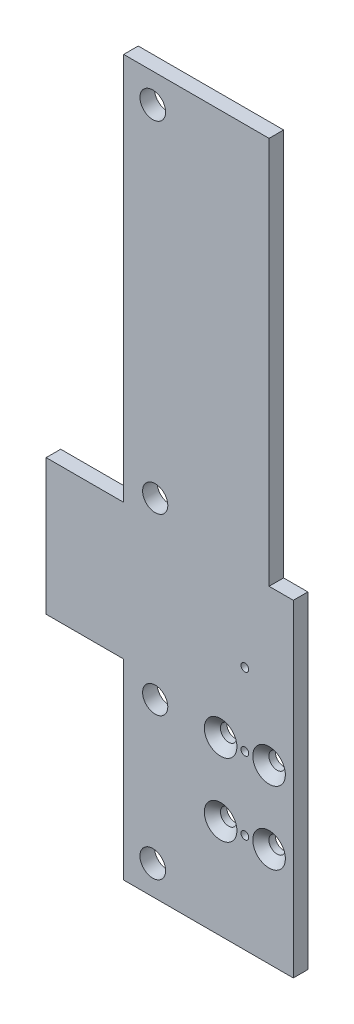
ISO-10303-21;
HEADER;
FILE_DESCRIPTION(('STEP AP214'),'2;1');
FILE_NAME('part.step','',(''),(''),'','','');
FILE_SCHEMA(('AUTOMOTIVE_DESIGN { 1 0 10303 214 1 1 1 1 }'));
ENDSEC;
DATA;
#1=APPLICATION_CONTEXT('core data for automotive mechanical design processes');
#2=APPLICATION_PROTOCOL_DEFINITION('international standard','automotive_design',2000,#1);
#3=PRODUCT_CONTEXT('',#1,'mechanical');
#4=PRODUCT('Part','Part','',(#3));
#5=PRODUCT_RELATED_PRODUCT_CATEGORY('part','',(#4));
#6=PRODUCT_DEFINITION_FORMATION('','',#4);
#7=PRODUCT_DEFINITION_CONTEXT('part definition',#1,'design');
#8=PRODUCT_DEFINITION('design','',#6,#7);
#9=PRODUCT_DEFINITION_SHAPE('','',#8);
#10=(LENGTH_UNIT() NAMED_UNIT(*) SI_UNIT(.MILLI.,.METRE.));
#11=(NAMED_UNIT(*) PLANE_ANGLE_UNIT() SI_UNIT($,.RADIAN.));
#12=(NAMED_UNIT(*) SI_UNIT($,.STERADIAN.) SOLID_ANGLE_UNIT());
#13=UNCERTAINTY_MEASURE_WITH_UNIT(LENGTH_MEASURE(1.E-05),#10,'distance_accuracy_value','');
#14=(GEOMETRIC_REPRESENTATION_CONTEXT(3) GLOBAL_UNCERTAINTY_ASSIGNED_CONTEXT((#13)) GLOBAL_UNIT_ASSIGNED_CONTEXT((#10,
#11,#12)) REPRESENTATION_CONTEXT('',''));
#15=CARTESIAN_POINT('',(0.,0.,0.));
#16=DIRECTION('',(0.,0.,1.));
#17=DIRECTION('',(1.,0.,0.));
#18=AXIS2_PLACEMENT_3D('',#15,#16,#17);
#19=CARTESIAN_POINT('',(-41.,32.,0.));
#20=DIRECTION('',(0.,1.,0.));
#21=DIRECTION('',(0.,0.,1.));
#22=AXIS2_PLACEMENT_3D('',#19,#20,#21);
#23=PLANE('',#22);
#24=DIRECTION('',(-1.,0.,0.));
#25=VECTOR('',#24,1.);
#26=CARTESIAN_POINT('',(-41.,32.,0.));
#27=LINE('',#26,#25);
#28=CARTESIAN_POINT('',(10.,32.,0.));
#29=VERTEX_POINT('',#28);
#30=CARTESIAN_POINT('',(5.00000000000001,32.,0.));
#31=VERTEX_POINT('',#30);
#32=EDGE_CURVE('E172',#29,#31,#27,.T.);
#33=ORIENTED_EDGE('',*,*,#32,.T.);
#34=DIRECTION('',(0.,0.,1.));
#35=VECTOR('',#34,1.);
#36=CARTESIAN_POINT('',(5.00000000000001,32.,0.));
#37=LINE('',#36,#35);
#38=CARTESIAN_POINT('',(5.00000000000001,32.,3.));
#39=VERTEX_POINT('',#38);
#40=EDGE_CURVE('E271',#31,#39,#37,.T.);
#41=ORIENTED_EDGE('',*,*,#40,.T.);
#42=DIRECTION('',(-1.,0.,0.));
#43=VECTOR('',#42,1.);
#44=CARTESIAN_POINT('',(-41.,32.,3.));
#45=LINE('',#44,#43);
#46=CARTESIAN_POINT('',(10.,32.,3.));
#47=VERTEX_POINT('',#46);
#48=EDGE_CURVE('E176',#47,#39,#45,.T.);
#49=ORIENTED_EDGE('',*,*,#48,.F.);
#50=DIRECTION('',(0.,0.,1.));
#51=VECTOR('',#50,1.);
#52=CARTESIAN_POINT('',(10.,32.,0.));
#53=LINE('',#52,#51);
#54=EDGE_CURVE('E164',#29,#47,#53,.T.);
#55=ORIENTED_EDGE('',*,*,#54,.F.);
#56=EDGE_LOOP('',(#33,#41,#49,#55));
#57=FACE_BOUND('',#56,.T.);
#58=ADVANCED_FACE('F45',(#57),#23,.T.);
#59=CARTESIAN_POINT('',(10.,-20.,3.));
#60=DIRECTION('',(-1.,0.,0.));
#61=DIRECTION('',(0.,0.,1.));
#62=AXIS2_PLACEMENT_3D('',#59,#60,#61);
#63=PLANE('',#62);
#64=DIRECTION('',(0.,1.,0.));
#65=VECTOR('',#64,1.);
#66=CARTESIAN_POINT('',(10.,-20.,0.));
#67=LINE('',#66,#65);
#68=CARTESIAN_POINT('',(10.,-35.5,0.));
#69=VERTEX_POINT('',#68);
#70=EDGE_CURVE('E49',#69,#29,#67,.T.);
#71=ORIENTED_EDGE('',*,*,#70,.T.);
#72=ORIENTED_EDGE('',*,*,#54,.T.);
#73=DIRECTION('',(0.,1.,0.));
#74=VECTOR('',#73,1.);
#75=CARTESIAN_POINT('',(10.,-20.,3.));
#76=LINE('',#75,#74);
#77=CARTESIAN_POINT('',(10.,-35.5,3.));
#78=VERTEX_POINT('',#77);
#79=EDGE_CURVE('E11',#78,#47,#76,.T.);
#80=ORIENTED_EDGE('',*,*,#79,.F.);
#81=DIRECTION('',(0.,0.,1.));
#82=VECTOR('',#81,1.);
#83=CARTESIAN_POINT('',(10.,-35.5,0.));
#84=LINE('',#83,#82);
#85=EDGE_CURVE('E306',#69,#78,#84,.T.);
#86=ORIENTED_EDGE('',*,*,#85,.F.);
#87=EDGE_LOOP('',(#71,#72,#80,#86));
#88=FACE_BOUND('',#87,.T.);
#89=ADVANCED_FACE('F47',(#88),#63,.F.);
#90=CARTESIAN_POINT('',(0.,0.,3.));
#91=DIRECTION('',(0.,0.,-1.));
#92=DIRECTION('',(-1.,0.,0.));
#93=AXIS2_PLACEMENT_3D('',#90,#91,#92);
#94=PLANE('',#93);
#95=CARTESIAN_POINT('',(-18.5,0.,3.));
#96=DIRECTION('',(0.,0.,1.));
#97=DIRECTION('',(1.,0.,0.));
#98=AXIS2_PLACEMENT_3D('',#95,#96,#97);
#99=CIRCLE('',#98,2.6);
#100=CARTESIAN_POINT('',(-15.9,0.,3.));
#101=VERTEX_POINT('',#100);
#102=EDGE_CURVE('E276',#101,#101,#99,.T.);
#103=ORIENTED_EDGE('',*,*,#102,.F.);
#104=EDGE_LOOP('',(#103));
#105=FACE_BOUND('',#104,.T.);
#106=CARTESIAN_POINT('',(-18.5,36.,3.));
#107=DIRECTION('',(0.,0.,1.));
#108=DIRECTION('',(-1.,0.,0.));
#109=AXIS2_PLACEMENT_3D('',#106,#107,#108);
#110=CIRCLE('',#109,2.6);
#111=CARTESIAN_POINT('',(-21.1,36.,3.));
#112=VERTEX_POINT('',#111);
#113=EDGE_CURVE('E294',#112,#112,#110,.T.);
#114=ORIENTED_EDGE('',*,*,#113,.F.);
#115=EDGE_LOOP('',(#114));
#116=FACE_BOUND('',#115,.T.);
#117=DIRECTION('',(1.,0.,0.));
#118=VECTOR('',#117,1.);
#119=CARTESIAN_POINT('',(-25.,-35.5,3.));
#120=LINE('',#119,#118);
#121=CARTESIAN_POINT('',(-25.,-35.5,3.));
#122=VERTEX_POINT('',#121);
#123=EDGE_CURVE('E160',#122,#78,#120,.T.);
#124=ORIENTED_EDGE('',*,*,#123,.T.);
#125=ORIENTED_EDGE('',*,*,#79,.T.);
#126=ORIENTED_EDGE('',*,*,#48,.T.);
#127=DIRECTION('',(0.,1.,0.));
#128=VECTOR('',#127,1.);
#129=CARTESIAN_POINT('',(5.,112.053183590918,3.));
#130=LINE('',#129,#128);
#131=CARTESIAN_POINT('',(5.,112.053183590918,3.));
#132=VERTEX_POINT('',#131);
#133=EDGE_CURVE('E63',#39,#132,#130,.T.);
#134=ORIENTED_EDGE('',*,*,#133,.T.);
#135=DIRECTION('',(-1.,0.,0.));
#136=VECTOR('',#135,1.);
#137=CARTESIAN_POINT('',(-25.,112.053183590918,3.));
#138=LINE('',#137,#136);
#139=CARTESIAN_POINT('',(-25.,112.053183590918,3.));
#140=VERTEX_POINT('',#139);
#141=EDGE_CURVE('E267',#132,#140,#138,.T.);
#142=ORIENTED_EDGE('',*,*,#141,.T.);
#143=DIRECTION('',(0.,-1.,0.));
#144=VECTOR('',#143,1.);
#145=CARTESIAN_POINT('',(-25.,32.,3.));
#146=LINE('',#145,#144);
#147=CARTESIAN_POINT('',(-25.,32.,3.));
#148=VERTEX_POINT('',#147);
#149=EDGE_CURVE('E321',#140,#148,#146,.T.);
#150=ORIENTED_EDGE('',*,*,#149,.T.);
#151=CARTESIAN_POINT('',(-41.,32.,3.));
#152=VERTEX_POINT('',#151);
#153=EDGE_CURVE('E181',#148,#152,#45,.T.);
#154=ORIENTED_EDGE('',*,*,#153,.T.);
#155=DIRECTION('',(0.,-1.,0.));
#156=VECTOR('',#155,1.);
#157=CARTESIAN_POINT('',(-41.,3.99999999999999,3.));
#158=LINE('',#157,#156);
#159=CARTESIAN_POINT('',(-41.,3.99999999999999,3.));
#160=VERTEX_POINT('',#159);
#161=EDGE_CURVE('E180',#152,#160,#158,.T.);
#162=ORIENTED_EDGE('',*,*,#161,.T.);
#163=DIRECTION('',(1.,0.,0.));
#164=VECTOR('',#163,1.);
#165=CARTESIAN_POINT('',(-10.,4.,3.));
#166=LINE('',#165,#164);
#167=CARTESIAN_POINT('',(-25.,3.99999999999999,3.));
#168=VERTEX_POINT('',#167);
#169=EDGE_CURVE('E184',#160,#168,#166,.T.);
#170=ORIENTED_EDGE('',*,*,#169,.T.);
#171=DIRECTION('',(0.,-1.,0.));
#172=VECTOR('',#171,1.);
#173=CARTESIAN_POINT('',(-25.,3.99999999999999,3.));
#174=LINE('',#173,#172);
#175=EDGE_CURVE('E145',#168,#122,#174,.T.);
#176=ORIENTED_EDGE('',*,*,#175,.T.);
#177=EDGE_LOOP('',(#124,#125,#126,#134,#142,#150,#154,#162,#170,#176));
#178=FACE_BOUND('',#177,.T.);
#179=CARTESIAN_POINT('',(0.,15.,3.));
#180=DIRECTION('',(0.,0.,1.));
#181=DIRECTION('',(1.,0.,0.));
#182=AXIS2_PLACEMENT_3D('',#179,#180,#181);
#183=CIRCLE('',#182,0.8);
#184=CARTESIAN_POINT('',(0.8,15.,3.));
#185=VERTEX_POINT('',#184);
#186=EDGE_CURVE('E190',#185,#185,#183,.T.);
#187=ORIENTED_EDGE('',*,*,#186,.F.);
#188=EDGE_LOOP('',(#187));
#189=FACE_BOUND('',#188,.T.);
#190=CARTESIAN_POINT('',(0.,0.,3.));
#191=DIRECTION('',(0.,0.,1.));
#192=DIRECTION('',(1.,0.,0.));
#193=AXIS2_PLACEMENT_3D('',#190,#191,#192);
#194=CIRCLE('',#193,0.8);
#195=CARTESIAN_POINT('',(0.8,0.,3.));
#196=VERTEX_POINT('',#195);
#197=EDGE_CURVE('E200',#196,#196,#194,.T.);
#198=ORIENTED_EDGE('',*,*,#197,.F.);
#199=EDGE_LOOP('',(#198));
#200=FACE_BOUND('',#199,.T.);
#201=CARTESIAN_POINT('',(0.,-15.,3.));
#202=DIRECTION('',(0.,0.,1.));
#203=DIRECTION('',(1.,0.,0.));
#204=AXIS2_PLACEMENT_3D('',#201,#202,#203);
#205=CIRCLE('',#204,0.8);
#206=CARTESIAN_POINT('',(0.8,-15.,3.));
#207=VERTEX_POINT('',#206);
#208=EDGE_CURVE('E208',#207,#207,#205,.T.);
#209=ORIENTED_EDGE('',*,*,#208,.F.);
#210=EDGE_LOOP('',(#209));
#211=FACE_BOUND('',#210,.T.);
#212=CARTESIAN_POINT('',(-5.,0.,3.));
#213=DIRECTION('',(0.,0.,1.));
#214=DIRECTION('',(1.,0.,0.));
#215=AXIS2_PLACEMENT_3D('',#212,#213,#214);
#216=CIRCLE('',#215,3.36);
#217=CARTESIAN_POINT('',(-1.64,0.,3.));
#218=VERTEX_POINT('',#217);
#219=EDGE_CURVE('E216',#218,#218,#216,.T.);
#220=ORIENTED_EDGE('',*,*,#219,.F.);
#221=EDGE_LOOP('',(#220));
#222=FACE_BOUND('',#221,.T.);
#223=CARTESIAN_POINT('',(5.,0.,3.));
#224=DIRECTION('',(0.,0.,1.));
#225=DIRECTION('',(1.,0.,0.));
#226=AXIS2_PLACEMENT_3D('',#223,#224,#225);
#227=CIRCLE('',#226,3.36);
#228=CARTESIAN_POINT('',(8.36,0.,3.));
#229=VERTEX_POINT('',#228);
#230=EDGE_CURVE('E228',#229,#229,#227,.T.);
#231=ORIENTED_EDGE('',*,*,#230,.F.);
#232=EDGE_LOOP('',(#231));
#233=FACE_BOUND('',#232,.T.);
#234=CARTESIAN_POINT('',(5.,-15.,3.));
#235=DIRECTION('',(0.,0.,1.));
#236=DIRECTION('',(1.,0.,0.));
#237=AXIS2_PLACEMENT_3D('',#234,#235,#236);
#238=CIRCLE('',#237,3.36);
#239=CARTESIAN_POINT('',(8.36,-15.,3.));
#240=VERTEX_POINT('',#239);
#241=EDGE_CURVE('E240',#240,#240,#238,.T.);
#242=ORIENTED_EDGE('',*,*,#241,.F.);
#243=EDGE_LOOP('',(#242));
#244=FACE_BOUND('',#243,.T.);
#245=CARTESIAN_POINT('',(-5.,-15.,3.));
#246=DIRECTION('',(0.,0.,1.));
#247=DIRECTION('',(1.,0.,0.));
#248=AXIS2_PLACEMENT_3D('',#245,#246,#247);
#249=CIRCLE('',#248,3.36);
#250=CARTESIAN_POINT('',(-1.64,-15.,3.));
#251=VERTEX_POINT('',#250);
#252=EDGE_CURVE('E252',#251,#251,#249,.T.);
#253=ORIENTED_EDGE('',*,*,#252,.F.);
#254=EDGE_LOOP('',(#253));
#255=FACE_BOUND('',#254,.T.);
#256=CARTESIAN_POINT('',(-19.,106.053183590918,3.));
#257=DIRECTION('',(0.,0.,1.));
#258=DIRECTION('',(1.,0.,0.));
#259=AXIS2_PLACEMENT_3D('',#256,#257,#258);
#260=CIRCLE('',#259,2.65);
#261=CARTESIAN_POINT('',(-16.35,106.053183590918,3.));
#262=VERTEX_POINT('',#261);
#263=EDGE_CURVE('E310',#262,#262,#260,.T.);
#264=ORIENTED_EDGE('',*,*,#263,.F.);
#265=EDGE_LOOP('',(#264));
#266=FACE_BOUND('',#265,.T.);
#267=CARTESIAN_POINT('',(-19.,-29.5,3.));
#268=DIRECTION('',(0.,0.,1.));
#269=DIRECTION('',(1.,0.,0.));
#270=AXIS2_PLACEMENT_3D('',#267,#268,#269);
#271=CIRCLE('',#270,2.65);
#272=CARTESIAN_POINT('',(-16.35,-29.5,3.));
#273=VERTEX_POINT('',#272);
#274=EDGE_CURVE('E283',#273,#273,#271,.T.);
#275=ORIENTED_EDGE('',*,*,#274,.F.);
#276=EDGE_LOOP('',(#275));
#277=FACE_BOUND('',#276,.T.);
#278=ADVANCED_FACE('F348',(#105,#116,#178,#189,#200,#211,#222,#233,#244,#255,#266,#277),#94,.F.);
#279=CARTESIAN_POINT('',(0.,0.,0.));
#280=DIRECTION('',(0.,0.,-1.));
#281=DIRECTION('',(-1.,0.,0.));
#282=AXIS2_PLACEMENT_3D('',#279,#280,#281);
#283=PLANE('',#282);
#284=CARTESIAN_POINT('',(-18.5,0.,0.));
#285=DIRECTION('',(0.,0.,1.));
#286=DIRECTION('',(1.,0.,0.));
#287=AXIS2_PLACEMENT_3D('',#284,#285,#286);
#288=CIRCLE('',#287,2.6);
#289=CARTESIAN_POINT('',(-15.9,0.,0.));
#290=VERTEX_POINT('',#289);
#291=EDGE_CURVE('E279',#290,#290,#288,.T.);
#292=ORIENTED_EDGE('',*,*,#291,.T.);
#293=EDGE_LOOP('',(#292));
#294=FACE_BOUND('',#293,.T.);
#295=CARTESIAN_POINT('',(-18.5,36.,0.));
#296=DIRECTION('',(0.,0.,1.));
#297=DIRECTION('',(-1.,0.,0.));
#298=AXIS2_PLACEMENT_3D('',#295,#296,#297);
#299=CIRCLE('',#298,2.6);
#300=CARTESIAN_POINT('',(-21.1,36.,0.));
#301=VERTEX_POINT('',#300);
#302=EDGE_CURVE('E280',#301,#301,#299,.T.);
#303=ORIENTED_EDGE('',*,*,#302,.T.);
#304=EDGE_LOOP('',(#303));
#305=FACE_BOUND('',#304,.T.);
#306=ORIENTED_EDGE('',*,*,#70,.F.);
#307=DIRECTION('',(1.,0.,0.));
#308=VECTOR('',#307,1.);
#309=CARTESIAN_POINT('',(-25.,-35.5,0.));
#310=LINE('',#309,#308);
#311=CARTESIAN_POINT('',(-25.,-35.5,0.));
#312=VERTEX_POINT('',#311);
#313=EDGE_CURVE('E149',#312,#69,#310,.T.);
#314=ORIENTED_EDGE('',*,*,#313,.F.);
#315=DIRECTION('',(0.,-1.,0.));
#316=VECTOR('',#315,1.);
#317=CARTESIAN_POINT('',(-25.,3.99999999999999,0.));
#318=LINE('',#317,#316);
#319=CARTESIAN_POINT('',(-25.,3.99999999999999,0.));
#320=VERTEX_POINT('',#319);
#321=EDGE_CURVE('E143',#320,#312,#318,.T.);
#322=ORIENTED_EDGE('',*,*,#321,.F.);
#323=DIRECTION('',(1.,0.,0.));
#324=VECTOR('',#323,1.);
#325=CARTESIAN_POINT('',(-10.,4.,0.));
#326=LINE('',#325,#324);
#327=CARTESIAN_POINT('',(-41.,3.99999999999999,0.));
#328=VERTEX_POINT('',#327);
#329=EDGE_CURVE('E157',#328,#320,#326,.T.);
#330=ORIENTED_EDGE('',*,*,#329,.F.);
#331=DIRECTION('',(0.,-1.,0.));
#332=VECTOR('',#331,1.);
#333=CARTESIAN_POINT('',(-41.,3.99999999999999,0.));
#334=LINE('',#333,#332);
#335=CARTESIAN_POINT('',(-41.,32.,0.));
#336=VERTEX_POINT('',#335);
#337=EDGE_CURVE('E165',#336,#328,#334,.T.);
#338=ORIENTED_EDGE('',*,*,#337,.F.);
#339=CARTESIAN_POINT('',(-25.,32.,0.));
#340=VERTEX_POINT('',#339);
#341=EDGE_CURVE('E187',#340,#336,#27,.T.);
#342=ORIENTED_EDGE('',*,*,#341,.F.);
#343=DIRECTION('',(0.,-1.,0.));
#344=VECTOR('',#343,1.);
#345=CARTESIAN_POINT('',(-25.,32.,0.));
#346=LINE('',#345,#344);
#347=CARTESIAN_POINT('',(-25.,112.053183590918,0.));
#348=VERTEX_POINT('',#347);
#349=EDGE_CURVE('E273',#348,#340,#346,.T.);
#350=ORIENTED_EDGE('',*,*,#349,.F.);
#351=DIRECTION('',(-1.,0.,0.));
#352=VECTOR('',#351,1.);
#353=CARTESIAN_POINT('',(-25.,112.053183590918,0.));
#354=LINE('',#353,#352);
#355=CARTESIAN_POINT('',(5.,112.053183590918,0.));
#356=VERTEX_POINT('',#355);
#357=EDGE_CURVE('E320',#356,#348,#354,.T.);
#358=ORIENTED_EDGE('',*,*,#357,.F.);
#359=DIRECTION('',(0.,1.,0.));
#360=VECTOR('',#359,1.);
#361=CARTESIAN_POINT('',(5.,112.053183590918,0.));
#362=LINE('',#361,#360);
#363=EDGE_CURVE('E316',#31,#356,#362,.T.);
#364=ORIENTED_EDGE('',*,*,#363,.F.);
#365=ORIENTED_EDGE('',*,*,#32,.F.);
#366=EDGE_LOOP('',(#306,#314,#322,#330,#338,#342,#350,#358,#364,#365));
#367=FACE_BOUND('',#366,.T.);
#368=CARTESIAN_POINT('',(0.,15.,0.));
#369=DIRECTION('',(0.,0.,1.));
#370=DIRECTION('',(1.,0.,0.));
#371=AXIS2_PLACEMENT_3D('',#368,#369,#370);
#372=CIRCLE('',#371,0.8);
#373=CARTESIAN_POINT('',(0.8,15.,0.));
#374=VERTEX_POINT('',#373);
#375=EDGE_CURVE('E196',#374,#374,#372,.T.);
#376=ORIENTED_EDGE('',*,*,#375,.T.);
#377=EDGE_LOOP('',(#376));
#378=FACE_BOUND('',#377,.T.);
#379=CARTESIAN_POINT('',(0.,0.,0.));
#380=DIRECTION('',(0.,0.,1.));
#381=DIRECTION('',(1.,0.,0.));
#382=AXIS2_PLACEMENT_3D('',#379,#380,#381);
#383=CIRCLE('',#382,0.8);
#384=CARTESIAN_POINT('',(0.8,0.,0.));
#385=VERTEX_POINT('',#384);
#386=EDGE_CURVE('E204',#385,#385,#383,.T.);
#387=ORIENTED_EDGE('',*,*,#386,.T.);
#388=EDGE_LOOP('',(#387));
#389=FACE_BOUND('',#388,.T.);
#390=CARTESIAN_POINT('',(0.,-15.,0.));
#391=DIRECTION('',(0.,0.,1.));
#392=DIRECTION('',(1.,0.,0.));
#393=AXIS2_PLACEMENT_3D('',#390,#391,#392);
#394=CIRCLE('',#393,0.8);
#395=CARTESIAN_POINT('',(0.8,-15.,0.));
#396=VERTEX_POINT('',#395);
#397=EDGE_CURVE('E212',#396,#396,#394,.T.);
#398=ORIENTED_EDGE('',*,*,#397,.T.);
#399=EDGE_LOOP('',(#398));
#400=FACE_BOUND('',#399,.T.);
#401=CARTESIAN_POINT('',(-5.,0.,0.));
#402=DIRECTION('',(0.,0.,1.));
#403=DIRECTION('',(1.,0.,0.));
#404=AXIS2_PLACEMENT_3D('',#401,#402,#403);
#405=CIRCLE('',#404,1.69999999999999);
#406=CARTESIAN_POINT('',(-3.30000000000001,0.,0.));
#407=VERTEX_POINT('',#406);
#408=EDGE_CURVE('E224',#407,#407,#405,.T.);
#409=ORIENTED_EDGE('',*,*,#408,.T.);
#410=EDGE_LOOP('',(#409));
#411=FACE_BOUND('',#410,.T.);
#412=CARTESIAN_POINT('',(5.,0.,0.));
#413=DIRECTION('',(0.,0.,1.));
#414=DIRECTION('',(1.,0.,0.));
#415=AXIS2_PLACEMENT_3D('',#412,#413,#414);
#416=CIRCLE('',#415,1.69999999999999);
#417=CARTESIAN_POINT('',(6.69999999999999,0.,0.));
#418=VERTEX_POINT('',#417);
#419=EDGE_CURVE('E236',#418,#418,#416,.T.);
#420=ORIENTED_EDGE('',*,*,#419,.T.);
#421=EDGE_LOOP('',(#420));
#422=FACE_BOUND('',#421,.T.);
#423=CARTESIAN_POINT('',(5.,-15.,0.));
#424=DIRECTION('',(0.,0.,1.));
#425=DIRECTION('',(1.,0.,0.));
#426=AXIS2_PLACEMENT_3D('',#423,#424,#425);
#427=CIRCLE('',#426,1.69999999999999);
#428=CARTESIAN_POINT('',(6.69999999999999,-15.,0.));
#429=VERTEX_POINT('',#428);
#430=EDGE_CURVE('E248',#429,#429,#427,.T.);
#431=ORIENTED_EDGE('',*,*,#430,.T.);
#432=EDGE_LOOP('',(#431));
#433=FACE_BOUND('',#432,.T.);
#434=CARTESIAN_POINT('',(-5.,-15.,0.));
#435=DIRECTION('',(0.,0.,1.));
#436=DIRECTION('',(1.,0.,0.));
#437=AXIS2_PLACEMENT_3D('',#434,#435,#436);
#438=CIRCLE('',#437,1.69999999999999);
#439=CARTESIAN_POINT('',(-3.30000000000001,-15.,0.));
#440=VERTEX_POINT('',#439);
#441=EDGE_CURVE('E260',#440,#440,#438,.T.);
#442=ORIENTED_EDGE('',*,*,#441,.T.);
#443=EDGE_LOOP('',(#442));
#444=FACE_BOUND('',#443,.T.);
#445=CARTESIAN_POINT('',(-19.,106.053183590918,0.));
#446=DIRECTION('',(0.,0.,1.));
#447=DIRECTION('',(1.,0.,0.));
#448=AXIS2_PLACEMENT_3D('',#445,#446,#447);
#449=CIRCLE('',#448,2.65);
#450=CARTESIAN_POINT('',(-16.35,106.053183590918,0.));
#451=VERTEX_POINT('',#450);
#452=EDGE_CURVE('E268',#451,#451,#449,.T.);
#453=ORIENTED_EDGE('',*,*,#452,.T.);
#454=EDGE_LOOP('',(#453));
#455=FACE_BOUND('',#454,.T.);
#456=CARTESIAN_POINT('',(-19.,-29.5,0.));
#457=DIRECTION('',(0.,0.,1.));
#458=DIRECTION('',(1.,0.,0.));
#459=AXIS2_PLACEMENT_3D('',#456,#457,#458);
#460=CIRCLE('',#459,2.65);
#461=CARTESIAN_POINT('',(-16.35,-29.5,0.));
#462=VERTEX_POINT('',#461);
#463=EDGE_CURVE('E289',#462,#462,#460,.T.);
#464=ORIENTED_EDGE('',*,*,#463,.T.);
#465=EDGE_LOOP('',(#464));
#466=FACE_BOUND('',#465,.T.);
#467=ADVANCED_FACE('F154',(#294,#305,#367,#378,#389,#400,#411,#422,#433,#444,#455,#466),#283,.T.);
#468=CARTESIAN_POINT('',(-5.,-15.,3.));
#469=DIRECTION('',(0.,0.,1.));
#470=DIRECTION('',(1.,0.,0.));
#471=AXIS2_PLACEMENT_3D('',#468,#469,#470);
#472=CYLINDRICAL_SURFACE('',#471,1.69999999999999);
#473=ORIENTED_EDGE('',*,*,#441,.F.);
#474=EDGE_LOOP('',(#473));
#475=FACE_BOUND('',#474,.T.);
#476=CARTESIAN_POINT('',(-5.,-15.,1.34));
#477=DIRECTION('',(0.,0.,1.));
#478=DIRECTION('',(1.,0.,0.));
#479=AXIS2_PLACEMENT_3D('',#476,#477,#478);
#480=CIRCLE('',#479,1.7);
#481=CARTESIAN_POINT('',(-3.3,-15.,1.34));
#482=VERTEX_POINT('',#481);
#483=EDGE_CURVE('E256',#482,#482,#480,.T.);
#484=ORIENTED_EDGE('',*,*,#483,.T.);
#485=EDGE_LOOP('',(#484));
#486=FACE_BOUND('',#485,.T.);
#487=ADVANCED_FACE('F466',(#475,#486),#472,.F.);
#488=CARTESIAN_POINT('',(-5.,-15.,3.));
#489=DIRECTION('',(0.,0.,1.));
#490=DIRECTION('',(1.,0.,0.));
#491=AXIS2_PLACEMENT_3D('',#488,#489,#490);
#492=CONICAL_SURFACE('',#491,3.36,0.785398163397449);
#493=ORIENTED_EDGE('',*,*,#483,.F.);
#494=EDGE_LOOP('',(#493));
#495=FACE_BOUND('',#494,.T.);
#496=ORIENTED_EDGE('',*,*,#252,.T.);
#497=EDGE_LOOP('',(#496));
#498=FACE_BOUND('',#497,.T.);
#499=ADVANCED_FACE('F513',(#495,#498),#492,.F.);
#500=CARTESIAN_POINT('',(5.,-15.,3.));
#501=DIRECTION('',(0.,0.,1.));
#502=DIRECTION('',(1.,0.,0.));
#503=AXIS2_PLACEMENT_3D('',#500,#501,#502);
#504=CYLINDRICAL_SURFACE('',#503,1.69999999999999);
#505=ORIENTED_EDGE('',*,*,#430,.F.);
#506=EDGE_LOOP('',(#505));
#507=FACE_BOUND('',#506,.T.);
#508=CARTESIAN_POINT('',(5.,-15.,1.34));
#509=DIRECTION('',(0.,0.,1.));
#510=DIRECTION('',(1.,0.,0.));
#511=AXIS2_PLACEMENT_3D('',#508,#509,#510);
#512=CIRCLE('',#511,1.7);
#513=CARTESIAN_POINT('',(6.7,-15.,1.34));
#514=VERTEX_POINT('',#513);
#515=EDGE_CURVE('E244',#514,#514,#512,.T.);
#516=ORIENTED_EDGE('',*,*,#515,.T.);
#517=EDGE_LOOP('',(#516));
#518=FACE_BOUND('',#517,.T.);
#519=ADVANCED_FACE('F521',(#507,#518),#504,.F.);
#520=CARTESIAN_POINT('',(5.,-15.,3.));
#521=DIRECTION('',(0.,0.,1.));
#522=DIRECTION('',(1.,0.,0.));
#523=AXIS2_PLACEMENT_3D('',#520,#521,#522);
#524=CONICAL_SURFACE('',#523,3.36,0.785398163397449);
#525=ORIENTED_EDGE('',*,*,#515,.F.);
#526=EDGE_LOOP('',(#525));
#527=FACE_BOUND('',#526,.T.);
#528=ORIENTED_EDGE('',*,*,#241,.T.);
#529=EDGE_LOOP('',(#528));
#530=FACE_BOUND('',#529,.T.);
#531=ADVANCED_FACE('F531',(#527,#530),#524,.F.);
#532=CARTESIAN_POINT('',(5.,0.,3.));
#533=DIRECTION('',(0.,0.,1.));
#534=DIRECTION('',(1.,0.,0.));
#535=AXIS2_PLACEMENT_3D('',#532,#533,#534);
#536=CYLINDRICAL_SURFACE('',#535,1.69999999999999);
#537=ORIENTED_EDGE('',*,*,#419,.F.);
#538=EDGE_LOOP('',(#537));
#539=FACE_BOUND('',#538,.T.);
#540=CARTESIAN_POINT('',(5.,0.,1.34));
#541=DIRECTION('',(0.,0.,1.));
#542=DIRECTION('',(1.,0.,0.));
#543=AXIS2_PLACEMENT_3D('',#540,#541,#542);
#544=CIRCLE('',#543,1.7);
#545=CARTESIAN_POINT('',(6.7,0.,1.34));
#546=VERTEX_POINT('',#545);
#547=EDGE_CURVE('E232',#546,#546,#544,.T.);
#548=ORIENTED_EDGE('',*,*,#547,.T.);
#549=EDGE_LOOP('',(#548));
#550=FACE_BOUND('',#549,.T.);
#551=ADVANCED_FACE('F539',(#539,#550),#536,.F.);
#552=CARTESIAN_POINT('',(5.,0.,3.));
#553=DIRECTION('',(0.,0.,1.));
#554=DIRECTION('',(1.,0.,0.));
#555=AXIS2_PLACEMENT_3D('',#552,#553,#554);
#556=CONICAL_SURFACE('',#555,3.36,0.785398163397448);
#557=ORIENTED_EDGE('',*,*,#547,.F.);
#558=EDGE_LOOP('',(#557));
#559=FACE_BOUND('',#558,.T.);
#560=ORIENTED_EDGE('',*,*,#230,.T.);
#561=EDGE_LOOP('',(#560));
#562=FACE_BOUND('',#561,.T.);
#563=ADVANCED_FACE('F547',(#559,#562),#556,.F.);
#564=CARTESIAN_POINT('',(-5.,0.,3.));
#565=DIRECTION('',(0.,0.,1.));
#566=DIRECTION('',(1.,0.,0.));
#567=AXIS2_PLACEMENT_3D('',#564,#565,#566);
#568=CYLINDRICAL_SURFACE('',#567,1.69999999999999);
#569=ORIENTED_EDGE('',*,*,#408,.F.);
#570=EDGE_LOOP('',(#569));
#571=FACE_BOUND('',#570,.T.);
#572=CARTESIAN_POINT('',(-5.,0.,1.34));
#573=DIRECTION('',(0.,0.,1.));
#574=DIRECTION('',(1.,0.,0.));
#575=AXIS2_PLACEMENT_3D('',#572,#573,#574);
#576=CIRCLE('',#575,1.7);
#577=CARTESIAN_POINT('',(-3.3,0.,1.34));
#578=VERTEX_POINT('',#577);
#579=EDGE_CURVE('E220',#578,#578,#576,.T.);
#580=ORIENTED_EDGE('',*,*,#579,.T.);
#581=EDGE_LOOP('',(#580));
#582=FACE_BOUND('',#581,.T.);
#583=ADVANCED_FACE('F501',(#571,#582),#568,.F.);
#584=CARTESIAN_POINT('',(-5.,0.,3.));
#585=DIRECTION('',(0.,0.,1.));
#586=DIRECTION('',(1.,0.,0.));
#587=AXIS2_PLACEMENT_3D('',#584,#585,#586);
#588=CONICAL_SURFACE('',#587,3.36,0.785398163397449);
#589=ORIENTED_EDGE('',*,*,#579,.F.);
#590=EDGE_LOOP('',(#589));
#591=FACE_BOUND('',#590,.T.);
#592=ORIENTED_EDGE('',*,*,#219,.T.);
#593=EDGE_LOOP('',(#592));
#594=FACE_BOUND('',#593,.T.);
#595=ADVANCED_FACE('F496',(#591,#594),#588,.F.);
#596=CARTESIAN_POINT('',(0.,-15.,3.));
#597=DIRECTION('',(0.,0.,1.));
#598=DIRECTION('',(1.,0.,0.));
#599=AXIS2_PLACEMENT_3D('',#596,#597,#598);
#600=CYLINDRICAL_SURFACE('',#599,0.8);
#601=ORIENTED_EDGE('',*,*,#397,.F.);
#602=EDGE_LOOP('',(#601));
#603=FACE_BOUND('',#602,.T.);
#604=ORIENTED_EDGE('',*,*,#208,.T.);
#605=EDGE_LOOP('',(#604));
#606=FACE_BOUND('',#605,.T.);
#607=ADVANCED_FACE('F500',(#603,#606),#600,.F.);
#608=CARTESIAN_POINT('',(0.,0.,3.));
#609=DIRECTION('',(0.,0.,1.));
#610=DIRECTION('',(1.,0.,0.));
#611=AXIS2_PLACEMENT_3D('',#608,#609,#610);
#612=CYLINDRICAL_SURFACE('',#611,0.8);
#613=ORIENTED_EDGE('',*,*,#386,.F.);
#614=EDGE_LOOP('',(#613));
#615=FACE_BOUND('',#614,.T.);
#616=ORIENTED_EDGE('',*,*,#197,.T.);
#617=EDGE_LOOP('',(#616));
#618=FACE_BOUND('',#617,.T.);
#619=ADVANCED_FACE('F573',(#615,#618),#612,.F.);
#620=CARTESIAN_POINT('',(0.,15.,3.));
#621=DIRECTION('',(0.,0.,1.));
#622=DIRECTION('',(1.,0.,0.));
#623=AXIS2_PLACEMENT_3D('',#620,#621,#622);
#624=CYLINDRICAL_SURFACE('',#623,0.8);
#625=ORIENTED_EDGE('',*,*,#375,.F.);
#626=EDGE_LOOP('',(#625));
#627=FACE_BOUND('',#626,.T.);
#628=ORIENTED_EDGE('',*,*,#186,.T.);
#629=EDGE_LOOP('',(#628));
#630=FACE_BOUND('',#629,.T.);
#631=ADVANCED_FACE('F391',(#627,#630),#624,.F.);
#632=CARTESIAN_POINT('',(-10.,4.,0.));
#633=DIRECTION('',(0.,-1.,0.));
#634=DIRECTION('',(1.,0.,0.));
#635=AXIS2_PLACEMENT_3D('',#632,#633,#634);
#636=PLANE('',#635);
#637=DIRECTION('',(0.,0.,1.));
#638=VECTOR('',#637,1.);
#639=CARTESIAN_POINT('',(-25.,3.99999999999999,0.));
#640=LINE('',#639,#638);
#641=EDGE_CURVE('E140',#320,#168,#640,.T.);
#642=ORIENTED_EDGE('',*,*,#641,.T.);
#643=ORIENTED_EDGE('',*,*,#169,.F.);
#644=DIRECTION('',(0.,0.,1.));
#645=VECTOR('',#644,1.);
#646=CARTESIAN_POINT('',(-41.,3.99999999999999,0.));
#647=LINE('',#646,#645);
#648=EDGE_CURVE('E75',#328,#160,#647,.T.);
#649=ORIENTED_EDGE('',*,*,#648,.F.);
#650=ORIENTED_EDGE('',*,*,#329,.T.);
#651=EDGE_LOOP('',(#642,#643,#649,#650));
#652=FACE_BOUND('',#651,.T.);
#653=ADVANCED_FACE('F162',(#652),#636,.T.);
#654=CARTESIAN_POINT('',(-41.,3.99999999999999,0.));
#655=DIRECTION('',(-1.,0.,0.));
#656=DIRECTION('',(0.,0.,1.));
#657=AXIS2_PLACEMENT_3D('',#654,#655,#656);
#658=PLANE('',#657);
#659=ORIENTED_EDGE('',*,*,#161,.F.);
#660=DIRECTION('',(0.,0.,1.));
#661=VECTOR('',#660,1.);
#662=CARTESIAN_POINT('',(-41.,32.,0.));
#663=LINE('',#662,#661);
#664=EDGE_CURVE('E169',#336,#152,#663,.T.);
#665=ORIENTED_EDGE('',*,*,#664,.F.);
#666=ORIENTED_EDGE('',*,*,#337,.T.);
#667=ORIENTED_EDGE('',*,*,#648,.T.);
#668=EDGE_LOOP('',(#659,#665,#666,#667));
#669=FACE_BOUND('',#668,.T.);
#670=ADVANCED_FACE('F346',(#669),#658,.T.);
#671=DIRECTION('',(0.,0.,1.));
#672=VECTOR('',#671,1.);
#673=CARTESIAN_POINT('',(-25.,32.,0.));
#674=LINE('',#673,#672);
#675=EDGE_CURVE('E331',#340,#148,#674,.T.);
#676=ORIENTED_EDGE('',*,*,#675,.F.);
#677=ORIENTED_EDGE('',*,*,#341,.T.);
#678=ORIENTED_EDGE('',*,*,#664,.T.);
#679=ORIENTED_EDGE('',*,*,#153,.F.);
#680=EDGE_LOOP('',(#676,#677,#678,#679));
#681=FACE_BOUND('',#680,.T.);
#682=ADVANCED_FACE('F343',(#681),#23,.T.);
#683=CARTESIAN_POINT('',(-25.,32.,0.));
#684=DIRECTION('',(-1.,0.,0.));
#685=DIRECTION('',(0.,0.,1.));
#686=AXIS2_PLACEMENT_3D('',#683,#684,#685);
#687=PLANE('',#686);
#688=ORIENTED_EDGE('',*,*,#149,.F.);
#689=DIRECTION('',(0.,0.,1.));
#690=VECTOR('',#689,1.);
#691=CARTESIAN_POINT('',(-25.,112.053183590918,0.));
#692=LINE('',#691,#690);
#693=EDGE_CURVE('E333',#348,#140,#692,.T.);
#694=ORIENTED_EDGE('',*,*,#693,.F.);
#695=ORIENTED_EDGE('',*,*,#349,.T.);
#696=ORIENTED_EDGE('',*,*,#675,.T.);
#697=EDGE_LOOP('',(#688,#694,#695,#696));
#698=FACE_BOUND('',#697,.T.);
#699=ADVANCED_FACE('F353',(#698),#687,.T.);
#700=CARTESIAN_POINT('',(-25.,112.053183590918,0.));
#701=DIRECTION('',(0.,1.,0.));
#702=DIRECTION('',(0.,0.,1.));
#703=AXIS2_PLACEMENT_3D('',#700,#701,#702);
#704=PLANE('',#703);
#705=ORIENTED_EDGE('',*,*,#141,.F.);
#706=DIRECTION('',(0.,0.,1.));
#707=VECTOR('',#706,1.);
#708=CARTESIAN_POINT('',(5.,112.053183590918,0.));
#709=LINE('',#708,#707);
#710=EDGE_CURVE('E272',#356,#132,#709,.T.);
#711=ORIENTED_EDGE('',*,*,#710,.F.);
#712=ORIENTED_EDGE('',*,*,#357,.T.);
#713=ORIENTED_EDGE('',*,*,#693,.T.);
#714=EDGE_LOOP('',(#705,#711,#712,#713));
#715=FACE_BOUND('',#714,.T.);
#716=ADVANCED_FACE('F386',(#715),#704,.T.);
#717=CARTESIAN_POINT('',(5.,112.053183590918,0.));
#718=DIRECTION('',(1.,0.,0.));
#719=DIRECTION('',(0.,1.,0.));
#720=AXIS2_PLACEMENT_3D('',#717,#718,#719);
#721=PLANE('',#720);
#722=ORIENTED_EDGE('',*,*,#133,.F.);
#723=ORIENTED_EDGE('',*,*,#40,.F.);
#724=ORIENTED_EDGE('',*,*,#363,.T.);
#725=ORIENTED_EDGE('',*,*,#710,.T.);
#726=EDGE_LOOP('',(#722,#723,#724,#725));
#727=FACE_BOUND('',#726,.T.);
#728=ADVANCED_FACE('F357',(#727),#721,.T.);
#729=CARTESIAN_POINT('',(-19.,106.053183590918,0.));
#730=DIRECTION('',(0.,0.,1.));
#731=DIRECTION('',(1.,0.,0.));
#732=AXIS2_PLACEMENT_3D('',#729,#730,#731);
#733=CYLINDRICAL_SURFACE('',#732,2.65);
#734=ORIENTED_EDGE('',*,*,#452,.F.);
#735=EDGE_LOOP('',(#734));
#736=FACE_BOUND('',#735,.T.);
#737=ORIENTED_EDGE('',*,*,#263,.T.);
#738=EDGE_LOOP('',(#737));
#739=FACE_BOUND('',#738,.T.);
#740=ADVANCED_FACE('F363',(#736,#739),#733,.F.);
#741=CARTESIAN_POINT('',(-25.,-35.5,0.));
#742=DIRECTION('',(0.,-1.,0.));
#743=DIRECTION('',(1.,0.,0.));
#744=AXIS2_PLACEMENT_3D('',#741,#742,#743);
#745=PLANE('',#744);
#746=ORIENTED_EDGE('',*,*,#123,.F.);
#747=DIRECTION('',(0.,0.,1.));
#748=VECTOR('',#747,1.);
#749=CARTESIAN_POINT('',(-25.,-35.5,0.));
#750=LINE('',#749,#748);
#751=EDGE_CURVE('E148',#312,#122,#750,.T.);
#752=ORIENTED_EDGE('',*,*,#751,.F.);
#753=ORIENTED_EDGE('',*,*,#313,.T.);
#754=ORIENTED_EDGE('',*,*,#85,.T.);
#755=EDGE_LOOP('',(#746,#752,#753,#754));
#756=FACE_BOUND('',#755,.T.);
#757=ADVANCED_FACE('F361',(#756),#745,.T.);
#758=CARTESIAN_POINT('',(-25.,3.99999999999999,0.));
#759=DIRECTION('',(-1.,0.,0.));
#760=DIRECTION('',(0.,-1.,0.));
#761=AXIS2_PLACEMENT_3D('',#758,#759,#760);
#762=PLANE('',#761);
#763=ORIENTED_EDGE('',*,*,#175,.F.);
#764=ORIENTED_EDGE('',*,*,#641,.F.);
#765=ORIENTED_EDGE('',*,*,#321,.T.);
#766=ORIENTED_EDGE('',*,*,#751,.T.);
#767=EDGE_LOOP('',(#763,#764,#765,#766));
#768=FACE_BOUND('',#767,.T.);
#769=ADVANCED_FACE('F142',(#768),#762,.T.);
#770=CARTESIAN_POINT('',(-19.,-29.5,0.));
#771=DIRECTION('',(0.,0.,1.));
#772=DIRECTION('',(1.,0.,0.));
#773=AXIS2_PLACEMENT_3D('',#770,#771,#772);
#774=CYLINDRICAL_SURFACE('',#773,2.65);
#775=ORIENTED_EDGE('',*,*,#463,.F.);
#776=EDGE_LOOP('',(#775));
#777=FACE_BOUND('',#776,.T.);
#778=ORIENTED_EDGE('',*,*,#274,.T.);
#779=EDGE_LOOP('',(#778));
#780=FACE_BOUND('',#779,.T.);
#781=ADVANCED_FACE('F369',(#777,#780),#774,.F.);
#782=CARTESIAN_POINT('',(-18.5,36.,0.));
#783=DIRECTION('',(0.,0.,1.));
#784=DIRECTION('',(1.,0.,0.));
#785=AXIS2_PLACEMENT_3D('',#782,#783,#784);
#786=CYLINDRICAL_SURFACE('',#785,2.6);
#787=ORIENTED_EDGE('',*,*,#302,.F.);
#788=EDGE_LOOP('',(#787));
#789=FACE_BOUND('',#788,.T.);
#790=ORIENTED_EDGE('',*,*,#113,.T.);
#791=EDGE_LOOP('',(#790));
#792=FACE_BOUND('',#791,.T.);
#793=ADVANCED_FACE('F447',(#789,#792),#786,.F.);
#794=CARTESIAN_POINT('',(-18.5,0.,0.));
#795=DIRECTION('',(0.,0.,1.));
#796=DIRECTION('',(1.,0.,0.));
#797=AXIS2_PLACEMENT_3D('',#794,#795,#796);
#798=CYLINDRICAL_SURFACE('',#797,2.6);
#799=ORIENTED_EDGE('',*,*,#291,.F.);
#800=EDGE_LOOP('',(#799));
#801=FACE_BOUND('',#800,.T.);
#802=ORIENTED_EDGE('',*,*,#102,.T.);
#803=EDGE_LOOP('',(#802));
#804=FACE_BOUND('',#803,.T.);
#805=ADVANCED_FACE('F473',(#801,#804),#798,.F.);
#806=CLOSED_SHELL('',(#58,#89,#278,#467,#487,#499,#519,#531,#551,#563,#583,#595,#607,#619,#631,
#653,#670,#682,#699,#716,#728,#740,#757,#769,#781,#793,#805));
#807=MANIFOLD_SOLID_BREP('B2',#806);
#808=ADVANCED_BREP_SHAPE_REPRESENTATION('',(#18,#807),#14);
#809=SHAPE_DEFINITION_REPRESENTATION(#9,#808);
ENDSEC;
END-ISO-10303-21;
